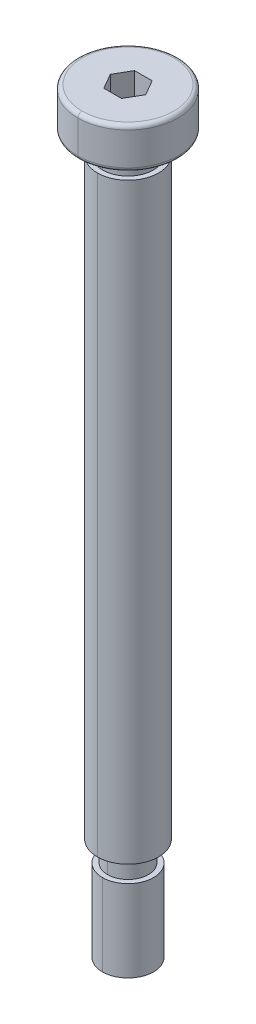
ISO-10303-21;
HEADER;
FILE_DESCRIPTION(('STEP AP214'),'2;1');
FILE_NAME('part.step','',(''),(''),'','','');
FILE_SCHEMA(('AUTOMOTIVE_DESIGN { 1 0 10303 214 1 1 1 1 }'));
ENDSEC;
DATA;
#1=APPLICATION_CONTEXT('core data for automotive mechanical design processes');
#2=APPLICATION_PROTOCOL_DEFINITION('international standard','automotive_design',2000,#1);
#3=PRODUCT_CONTEXT('',#1,'mechanical');
#4=PRODUCT('Part','Part','',(#3));
#5=PRODUCT_RELATED_PRODUCT_CATEGORY('part','',(#4));
#6=PRODUCT_DEFINITION_FORMATION('','',#4);
#7=PRODUCT_DEFINITION_CONTEXT('part definition',#1,'design');
#8=PRODUCT_DEFINITION('design','',#6,#7);
#9=PRODUCT_DEFINITION_SHAPE('','',#8);
#10=(LENGTH_UNIT() NAMED_UNIT(*) SI_UNIT(.MILLI.,.METRE.));
#11=(NAMED_UNIT(*) PLANE_ANGLE_UNIT() SI_UNIT($,.RADIAN.));
#12=(NAMED_UNIT(*) SI_UNIT($,.STERADIAN.) SOLID_ANGLE_UNIT());
#13=UNCERTAINTY_MEASURE_WITH_UNIT(LENGTH_MEASURE(1.E-05),#10,'distance_accuracy_value','');
#14=(GEOMETRIC_REPRESENTATION_CONTEXT(3) GLOBAL_UNCERTAINTY_ASSIGNED_CONTEXT((#13)) GLOBAL_UNIT_ASSIGNED_CONTEXT((#10,
#11,#12)) REPRESENTATION_CONTEXT('',''));
#15=CARTESIAN_POINT('',(0.,0.,0.));
#16=DIRECTION('',(0.,0.,1.));
#17=DIRECTION('',(1.,0.,0.));
#18=AXIS2_PLACEMENT_3D('',#15,#16,#17);
#19=CARTESIAN_POINT('',(0.,70.5,0.));
#20=DIRECTION('',(0.,1.,0.));
#21=DIRECTION('',(1.,0.,0.));
#22=AXIS2_PLACEMENT_3D('',#19,#20,#21);
#23=PLANE('',#22);
#24=DIRECTION('',(-0.5,0.,-0.866025403784439));
#25=VECTOR('',#24,1.);
#26=CARTESIAN_POINT('',(1.73205080756888,70.5,0.));
#27=LINE('',#26,#25);
#28=CARTESIAN_POINT('',(1.73205080756888,70.5,0.));
#29=VERTEX_POINT('',#28);
#30=CARTESIAN_POINT('',(0.866025403784438,70.5,-1.5));
#31=VERTEX_POINT('',#30);
#32=EDGE_CURVE('E305',#29,#31,#27,.T.);
#33=ORIENTED_EDGE('',*,*,#32,.T.);
#34=DIRECTION('',(-1.,0.,0.));
#35=VECTOR('',#34,1.);
#36=CARTESIAN_POINT('',(0.866025403784438,70.5,-1.5));
#37=LINE('',#36,#35);
#38=CARTESIAN_POINT('',(-0.866025403784439,70.5,-1.5));
#39=VERTEX_POINT('',#38);
#40=EDGE_CURVE('E10',#31,#39,#37,.T.);
#41=ORIENTED_EDGE('',*,*,#40,.T.);
#42=DIRECTION('',(-0.5,0.,0.866025403784439));
#43=VECTOR('',#42,1.);
#44=CARTESIAN_POINT('',(-0.866025403784439,70.5,-1.5));
#45=LINE('',#44,#43);
#46=CARTESIAN_POINT('',(-1.73205080756888,70.5,0.));
#47=VERTEX_POINT('',#46);
#48=EDGE_CURVE('E44',#39,#47,#45,.T.);
#49=ORIENTED_EDGE('',*,*,#48,.T.);
#50=DIRECTION('',(0.5,0.,0.866025403784439));
#51=VECTOR('',#50,1.);
#52=CARTESIAN_POINT('',(-1.73205080756888,70.5,0.));
#53=LINE('',#52,#51);
#54=CARTESIAN_POINT('',(-0.866025403784439,70.5,1.5));
#55=VERTEX_POINT('',#54);
#56=EDGE_CURVE('E284',#47,#55,#53,.T.);
#57=ORIENTED_EDGE('',*,*,#56,.T.);
#58=DIRECTION('',(1.,0.,0.));
#59=VECTOR('',#58,1.);
#60=CARTESIAN_POINT('',(-0.866025403784439,70.5,1.5));
#61=LINE('',#60,#59);
#62=CARTESIAN_POINT('',(0.866025403784438,70.5,1.5));
#63=VERTEX_POINT('',#62);
#64=EDGE_CURVE('E325',#55,#63,#61,.T.);
#65=ORIENTED_EDGE('',*,*,#64,.T.);
#66=DIRECTION('',(0.5,0.,-0.866025403784439));
#67=VECTOR('',#66,1.);
#68=CARTESIAN_POINT('',(0.866025403784438,70.5,1.5));
#69=LINE('',#68,#67);
#70=EDGE_CURVE('E310',#63,#29,#69,.T.);
#71=ORIENTED_EDGE('',*,*,#70,.T.);
#72=EDGE_LOOP('',(#33,#41,#49,#57,#65,#71));
#73=FACE_BOUND('',#72,.T.);
#74=ADVANCED_FACE('F16',(#73),#23,.T.);
#75=CARTESIAN_POINT('',(0.866025403784438,70.5,-1.5));
#76=DIRECTION('',(0.,0.,-1.));
#77=DIRECTION('',(-1.,0.,0.));
#78=AXIS2_PLACEMENT_3D('',#75,#76,#77);
#79=PLANE('',#78);
#80=DIRECTION('',(-1.,0.,0.));
#81=VECTOR('',#80,1.);
#82=CARTESIAN_POINT('',(0.866025403784438,74.,-1.5));
#83=LINE('',#82,#81);
#84=CARTESIAN_POINT('',(0.866025403784438,74.,-1.5));
#85=VERTEX_POINT('',#84);
#86=CARTESIAN_POINT('',(-0.866025403784439,74.,-1.5));
#87=VERTEX_POINT('',#86);
#88=EDGE_CURVE('E259',#85,#87,#83,.T.);
#89=ORIENTED_EDGE('',*,*,#88,.T.);
#90=DIRECTION('',(0.,1.,0.));
#91=VECTOR('',#90,1.);
#92=CARTESIAN_POINT('',(-0.866025403784439,70.5,-1.5));
#93=LINE('',#92,#91);
#94=EDGE_CURVE('E19',#39,#87,#93,.T.);
#95=ORIENTED_EDGE('',*,*,#94,.F.);
#96=ORIENTED_EDGE('',*,*,#40,.F.);
#97=DIRECTION('',(0.,1.,0.));
#98=VECTOR('',#97,1.);
#99=CARTESIAN_POINT('',(0.866025403784438,70.5,-1.5));
#100=LINE('',#99,#98);
#101=EDGE_CURVE('E302',#31,#85,#100,.T.);
#102=ORIENTED_EDGE('',*,*,#101,.T.);
#103=EDGE_LOOP('',(#89,#95,#96,#102));
#104=FACE_BOUND('',#103,.T.);
#105=ADVANCED_FACE('F401',(#104),#79,.F.);
#106=CARTESIAN_POINT('',(-0.866025403784439,70.5,-1.5));
#107=DIRECTION('',(-0.866025403784439,0.,-0.5));
#108=DIRECTION('',(-0.5,0.,0.866025403784439));
#109=AXIS2_PLACEMENT_3D('',#106,#107,#108);
#110=PLANE('',#109);
#111=DIRECTION('',(-0.5,0.,0.866025403784439));
#112=VECTOR('',#111,1.);
#113=CARTESIAN_POINT('',(-0.866025403784439,74.,-1.5));
#114=LINE('',#113,#112);
#115=CARTESIAN_POINT('',(-1.73205080756888,74.,0.));
#116=VERTEX_POINT('',#115);
#117=EDGE_CURVE('E350',#87,#116,#114,.T.);
#118=ORIENTED_EDGE('',*,*,#117,.T.);
#119=DIRECTION('',(0.,1.,0.));
#120=VECTOR('',#119,1.);
#121=CARTESIAN_POINT('',(-1.73205080756888,70.5,0.));
#122=LINE('',#121,#120);
#123=EDGE_CURVE('E287',#47,#116,#122,.T.);
#124=ORIENTED_EDGE('',*,*,#123,.F.);
#125=ORIENTED_EDGE('',*,*,#48,.F.);
#126=ORIENTED_EDGE('',*,*,#94,.T.);
#127=EDGE_LOOP('',(#118,#124,#125,#126));
#128=FACE_BOUND('',#127,.T.);
#129=ADVANCED_FACE('F392',(#128),#110,.F.);
#130=CARTESIAN_POINT('',(-1.73205080756888,70.5,0.));
#131=DIRECTION('',(-0.866025403784439,0.,0.5));
#132=DIRECTION('',(0.,1.,0.));
#133=AXIS2_PLACEMENT_3D('',#130,#131,#132);
#134=PLANE('',#133);
#135=DIRECTION('',(0.5,0.,0.866025403784439));
#136=VECTOR('',#135,1.);
#137=CARTESIAN_POINT('',(-1.73205080756888,74.,0.));
#138=LINE('',#137,#136);
#139=CARTESIAN_POINT('',(-0.866025403784439,74.,1.5));
#140=VERTEX_POINT('',#139);
#141=EDGE_CURVE('E346',#116,#140,#138,.T.);
#142=ORIENTED_EDGE('',*,*,#141,.T.);
#143=DIRECTION('',(0.,1.,0.));
#144=VECTOR('',#143,1.);
#145=CARTESIAN_POINT('',(-0.866025403784439,70.5,1.5));
#146=LINE('',#145,#144);
#147=EDGE_CURVE('E288',#55,#140,#146,.T.);
#148=ORIENTED_EDGE('',*,*,#147,.F.);
#149=ORIENTED_EDGE('',*,*,#56,.F.);
#150=ORIENTED_EDGE('',*,*,#123,.T.);
#151=EDGE_LOOP('',(#142,#148,#149,#150));
#152=FACE_BOUND('',#151,.T.);
#153=ADVANCED_FACE('F418',(#152),#134,.F.);
#154=CARTESIAN_POINT('',(-0.866025403784439,70.5,1.5));
#155=DIRECTION('',(0.,0.,1.));
#156=DIRECTION('',(1.,0.,0.));
#157=AXIS2_PLACEMENT_3D('',#154,#155,#156);
#158=PLANE('',#157);
#159=DIRECTION('',(1.,0.,0.));
#160=VECTOR('',#159,1.);
#161=CARTESIAN_POINT('',(-0.866025403784439,74.,1.5));
#162=LINE('',#161,#160);
#163=CARTESIAN_POINT('',(0.866025403784438,74.,1.5));
#164=VERTEX_POINT('',#163);
#165=EDGE_CURVE('E342',#140,#164,#162,.T.);
#166=ORIENTED_EDGE('',*,*,#165,.T.);
#167=DIRECTION('',(0.,1.,0.));
#168=VECTOR('',#167,1.);
#169=CARTESIAN_POINT('',(0.866025403784438,70.5,1.5));
#170=LINE('',#169,#168);
#171=EDGE_CURVE('E312',#63,#164,#170,.T.);
#172=ORIENTED_EDGE('',*,*,#171,.F.);
#173=ORIENTED_EDGE('',*,*,#64,.F.);
#174=ORIENTED_EDGE('',*,*,#147,.T.);
#175=EDGE_LOOP('',(#166,#172,#173,#174));
#176=FACE_BOUND('',#175,.T.);
#177=ADVANCED_FACE('F414',(#176),#158,.F.);
#178=CARTESIAN_POINT('',(0.866025403784438,70.5,1.5));
#179=DIRECTION('',(0.866025403784439,0.,0.5));
#180=DIRECTION('',(0.,-1.,0.));
#181=AXIS2_PLACEMENT_3D('',#178,#179,#180);
#182=PLANE('',#181);
#183=DIRECTION('',(0.5,0.,-0.866025403784439));
#184=VECTOR('',#183,1.);
#185=CARTESIAN_POINT('',(0.866025403784438,74.,1.5));
#186=LINE('',#185,#184);
#187=CARTESIAN_POINT('',(1.73205080756888,74.,0.));
#188=VERTEX_POINT('',#187);
#189=EDGE_CURVE('E258',#164,#188,#186,.T.);
#190=ORIENTED_EDGE('',*,*,#189,.T.);
#191=DIRECTION('',(0.,1.,0.));
#192=VECTOR('',#191,1.);
#193=CARTESIAN_POINT('',(1.73205080756888,70.5,0.));
#194=LINE('',#193,#192);
#195=EDGE_CURVE('E313',#29,#188,#194,.T.);
#196=ORIENTED_EDGE('',*,*,#195,.F.);
#197=ORIENTED_EDGE('',*,*,#70,.F.);
#198=ORIENTED_EDGE('',*,*,#171,.T.);
#199=EDGE_LOOP('',(#190,#196,#197,#198));
#200=FACE_BOUND('',#199,.T.);
#201=ADVANCED_FACE('F409',(#200),#182,.F.);
#202=CARTESIAN_POINT('',(1.73205080756888,70.5,0.));
#203=DIRECTION('',(0.866025403784439,0.,-0.5));
#204=DIRECTION('',(0.,-1.,0.));
#205=AXIS2_PLACEMENT_3D('',#202,#203,#204);
#206=PLANE('',#205);
#207=DIRECTION('',(-0.5,0.,-0.866025403784439));
#208=VECTOR('',#207,1.);
#209=CARTESIAN_POINT('',(1.73205080756888,74.,0.));
#210=LINE('',#209,#208);
#211=EDGE_CURVE('E254',#188,#85,#210,.T.);
#212=ORIENTED_EDGE('',*,*,#211,.T.);
#213=ORIENTED_EDGE('',*,*,#101,.F.);
#214=ORIENTED_EDGE('',*,*,#32,.F.);
#215=ORIENTED_EDGE('',*,*,#195,.T.);
#216=EDGE_LOOP('',(#212,#213,#214,#215));
#217=FACE_BOUND('',#216,.T.);
#218=ADVANCED_FACE('F405',(#217),#206,.F.);
#219=CARTESIAN_POINT('',(-2.5,0.,0.));
#220=DIRECTION('',(0.,1.,0.));
#221=DIRECTION('',(1.,0.,0.));
#222=AXIS2_PLACEMENT_3D('',#219,#220,#221);
#223=PLANE('',#222);
#224=CARTESIAN_POINT('',(0.,0.,0.));
#225=DIRECTION('',(0.,-1.,0.));
#226=DIRECTION('',(0.,0.,-1.));
#227=AXIS2_PLACEMENT_3D('',#224,#225,#226);
#228=CIRCLE('',#227,2.5);
#229=CARTESIAN_POINT('',(0.,0.,-2.5));
#230=VERTEX_POINT('',#229);
#231=CARTESIAN_POINT('',(0.,0.,2.5));
#232=VERTEX_POINT('',#231);
#233=EDGE_CURVE('E202',#230,#232,#228,.T.);
#234=ORIENTED_EDGE('',*,*,#233,.T.);
#235=CARTESIAN_POINT('',(0.,0.,0.));
#236=DIRECTION('',(0.,-1.,0.));
#237=DIRECTION('',(0.,0.,-1.));
#238=AXIS2_PLACEMENT_3D('',#235,#236,#237);
#239=CIRCLE('',#238,2.5);
#240=EDGE_CURVE('E195',#232,#230,#239,.T.);
#241=ORIENTED_EDGE('',*,*,#240,.T.);
#242=EDGE_LOOP('',(#234,#241));
#243=FACE_BOUND('',#242,.T.);
#244=ADVANCED_FACE('F433',(#243),#223,.F.);
#245=CARTESIAN_POINT('',(0.,0.,0.));
#246=DIRECTION('',(0.,-1.,0.));
#247=DIRECTION('',(0.,0.,-1.));
#248=AXIS2_PLACEMENT_3D('',#245,#246,#247);
#249=CYLINDRICAL_SURFACE('',#248,2.5);
#250=DIRECTION('',(0.,-1.,0.));
#251=VECTOR('',#250,1.);
#252=CARTESIAN_POINT('',(0.,0.,2.5));
#253=LINE('',#252,#251);
#254=CARTESIAN_POINT('',(0.,8.,2.5));
#255=VERTEX_POINT('',#254);
#256=EDGE_CURVE('E190',#255,#232,#253,.T.);
#257=ORIENTED_EDGE('',*,*,#256,.F.);
#258=CARTESIAN_POINT('',(0.,8.,0.));
#259=DIRECTION('',(0.,-1.,0.));
#260=DIRECTION('',(0.,0.,-1.));
#261=AXIS2_PLACEMENT_3D('',#258,#259,#260);
#262=CIRCLE('',#261,2.5);
#263=CARTESIAN_POINT('',(0.,8.,-2.5));
#264=VERTEX_POINT('',#263);
#265=EDGE_CURVE('E184',#255,#264,#262,.T.);
#266=ORIENTED_EDGE('',*,*,#265,.T.);
#267=DIRECTION('',(0.,-1.,0.));
#268=VECTOR('',#267,1.);
#269=CARTESIAN_POINT('',(0.,0.,-2.5));
#270=LINE('',#269,#268);
#271=EDGE_CURVE('E187',#264,#230,#270,.T.);
#272=ORIENTED_EDGE('',*,*,#271,.T.);
#273=ORIENTED_EDGE('',*,*,#240,.F.);
#274=EDGE_LOOP('',(#257,#266,#272,#273));
#275=FACE_BOUND('',#274,.T.);
#276=ADVANCED_FACE('F186',(#275),#249,.T.);
#277=CARTESIAN_POINT('',(-2.,8.,0.));
#278=DIRECTION('',(0.,-1.,0.));
#279=DIRECTION('',(0.,0.,-1.));
#280=AXIS2_PLACEMENT_3D('',#277,#278,#279);
#281=PLANE('',#280);
#282=CARTESIAN_POINT('',(0.,8.,0.));
#283=DIRECTION('',(0.,-1.,0.));
#284=DIRECTION('',(0.,0.,-1.));
#285=AXIS2_PLACEMENT_3D('',#282,#283,#284);
#286=CIRCLE('',#285,2.);
#287=CARTESIAN_POINT('',(0.,8.,-2.));
#288=VERTEX_POINT('',#287);
#289=CARTESIAN_POINT('',(0.,8.,2.));
#290=VERTEX_POINT('',#289);
#291=EDGE_CURVE('E247',#288,#290,#286,.T.);
#292=ORIENTED_EDGE('',*,*,#291,.T.);
#293=CARTESIAN_POINT('',(0.,8.,0.));
#294=DIRECTION('',(0.,-1.,0.));
#295=DIRECTION('',(0.,0.,-1.));
#296=AXIS2_PLACEMENT_3D('',#293,#294,#295);
#297=CIRCLE('',#296,2.);
#298=EDGE_CURVE('E196',#290,#288,#297,.T.);
#299=ORIENTED_EDGE('',*,*,#298,.T.);
#300=EDGE_LOOP('',(#292,#299));
#301=FACE_BOUND('',#300,.T.);
#302=CARTESIAN_POINT('',(0.,8.,0.));
#303=DIRECTION('',(0.,-1.,0.));
#304=DIRECTION('',(0.,0.,-1.));
#305=AXIS2_PLACEMENT_3D('',#302,#303,#304);
#306=CIRCLE('',#305,2.5);
#307=EDGE_CURVE('E200',#264,#255,#306,.T.);
#308=ORIENTED_EDGE('',*,*,#307,.F.);
#309=ORIENTED_EDGE('',*,*,#265,.F.);
#310=EDGE_LOOP('',(#308,#309));
#311=FACE_BOUND('',#310,.T.);
#312=ADVANCED_FACE('F206',(#301,#311),#281,.F.);
#313=CARTESIAN_POINT('',(0.,0.,0.));
#314=DIRECTION('',(0.,-1.,0.));
#315=DIRECTION('',(0.,0.,-1.));
#316=AXIS2_PLACEMENT_3D('',#313,#314,#315);
#317=CYLINDRICAL_SURFACE('',#316,2.);
#318=DIRECTION('',(0.,-1.,0.));
#319=VECTOR('',#318,1.);
#320=CARTESIAN_POINT('',(0.,0.,2.));
#321=LINE('',#320,#319);
#322=CARTESIAN_POINT('',(0.,10.,2.));
#323=VERTEX_POINT('',#322);
#324=EDGE_CURVE('E238',#323,#290,#321,.T.);
#325=ORIENTED_EDGE('',*,*,#324,.F.);
#326=CARTESIAN_POINT('',(0.,10.,0.));
#327=DIRECTION('',(0.,-1.,0.));
#328=DIRECTION('',(0.,0.,-1.));
#329=AXIS2_PLACEMENT_3D('',#326,#327,#328);
#330=CIRCLE('',#329,2.);
#331=CARTESIAN_POINT('',(0.,10.,-2.));
#332=VERTEX_POINT('',#331);
#333=EDGE_CURVE('E265',#323,#332,#330,.T.);
#334=ORIENTED_EDGE('',*,*,#333,.T.);
#335=DIRECTION('',(0.,-1.,0.));
#336=VECTOR('',#335,1.);
#337=CARTESIAN_POINT('',(0.,0.,-2.));
#338=LINE('',#337,#336);
#339=EDGE_CURVE('E243',#332,#288,#338,.T.);
#340=ORIENTED_EDGE('',*,*,#339,.T.);
#341=ORIENTED_EDGE('',*,*,#298,.F.);
#342=EDGE_LOOP('',(#325,#334,#340,#341));
#343=FACE_BOUND('',#342,.T.);
#344=ADVANCED_FACE('F441',(#343),#317,.T.);
#345=CARTESIAN_POINT('',(-3.,10.,0.));
#346=DIRECTION('',(0.,1.,0.));
#347=DIRECTION('',(1.,0.,0.));
#348=AXIS2_PLACEMENT_3D('',#345,#346,#347);
#349=PLANE('',#348);
#350=CARTESIAN_POINT('',(0.,10.,0.));
#351=DIRECTION('',(0.,-1.,0.));
#352=DIRECTION('',(0.,0.,-1.));
#353=AXIS2_PLACEMENT_3D('',#350,#351,#352);
#354=CIRCLE('',#353,2.);
#355=EDGE_CURVE('E204',#332,#323,#354,.T.);
#356=ORIENTED_EDGE('',*,*,#355,.F.);
#357=ORIENTED_EDGE('',*,*,#333,.F.);
#358=EDGE_LOOP('',(#356,#357));
#359=FACE_BOUND('',#358,.T.);
#360=CARTESIAN_POINT('',(0.,10.,0.));
#361=DIRECTION('',(0.,-1.,0.));
#362=DIRECTION('',(0.,0.,-1.));
#363=AXIS2_PLACEMENT_3D('',#360,#361,#362);
#364=CIRCLE('',#363,3.);
#365=CARTESIAN_POINT('',(0.,10.,-3.));
#366=VERTEX_POINT('',#365);
#367=CARTESIAN_POINT('',(0.,10.,3.));
#368=VERTEX_POINT('',#367);
#369=EDGE_CURVE('E229',#366,#368,#364,.T.);
#370=ORIENTED_EDGE('',*,*,#369,.T.);
#371=CARTESIAN_POINT('',(0.,10.,0.));
#372=DIRECTION('',(0.,-1.,0.));
#373=DIRECTION('',(0.,0.,-1.));
#374=AXIS2_PLACEMENT_3D('',#371,#372,#373);
#375=CIRCLE('',#374,3.);
#376=EDGE_CURVE('E367',#368,#366,#375,.T.);
#377=ORIENTED_EDGE('',*,*,#376,.T.);
#378=EDGE_LOOP('',(#370,#377));
#379=FACE_BOUND('',#378,.T.);
#380=ADVANCED_FACE('F445',(#359,#379),#349,.F.);
#381=CARTESIAN_POINT('',(0.,0.,0.));
#382=DIRECTION('',(0.,-1.,0.));
#383=DIRECTION('',(0.,0.,-1.));
#384=AXIS2_PLACEMENT_3D('',#381,#382,#383);
#385=CYLINDRICAL_SURFACE('',#384,3.);
#386=DIRECTION('',(0.,-1.,0.));
#387=VECTOR('',#386,1.);
#388=CARTESIAN_POINT('',(0.,0.,3.));
#389=LINE('',#388,#387);
#390=CARTESIAN_POINT('',(0.,68.,3.));
#391=VERTEX_POINT('',#390);
#392=EDGE_CURVE('E234',#391,#368,#389,.T.);
#393=ORIENTED_EDGE('',*,*,#392,.F.);
#394=CARTESIAN_POINT('',(0.,68.,0.));
#395=DIRECTION('',(0.,-1.,0.));
#396=DIRECTION('',(0.,0.,-1.));
#397=AXIS2_PLACEMENT_3D('',#394,#395,#396);
#398=CIRCLE('',#397,3.);
#399=CARTESIAN_POINT('',(0.,68.,-3.));
#400=VERTEX_POINT('',#399);
#401=EDGE_CURVE('E364',#391,#400,#398,.T.);
#402=ORIENTED_EDGE('',*,*,#401,.T.);
#403=DIRECTION('',(0.,-1.,0.));
#404=VECTOR('',#403,1.);
#405=CARTESIAN_POINT('',(0.,0.,-3.));
#406=LINE('',#405,#404);
#407=EDGE_CURVE('E225',#400,#366,#406,.T.);
#408=ORIENTED_EDGE('',*,*,#407,.T.);
#409=ORIENTED_EDGE('',*,*,#376,.F.);
#410=EDGE_LOOP('',(#393,#402,#408,#409));
#411=FACE_BOUND('',#410,.T.);
#412=ADVANCED_FACE('F449',(#411),#385,.T.);
#413=CARTESIAN_POINT('',(-2.5,68.,0.));
#414=DIRECTION('',(0.,-1.,0.));
#415=DIRECTION('',(0.,0.,-1.));
#416=AXIS2_PLACEMENT_3D('',#413,#414,#415);
#417=PLANE('',#416);
#418=CARTESIAN_POINT('',(0.,68.,0.));
#419=DIRECTION('',(0.,-1.,0.));
#420=DIRECTION('',(0.,0.,-1.));
#421=AXIS2_PLACEMENT_3D('',#418,#419,#420);
#422=CIRCLE('',#421,2.5);
#423=CARTESIAN_POINT('',(0.,68.,-2.5));
#424=VERTEX_POINT('',#423);
#425=CARTESIAN_POINT('',(0.,68.,2.5));
#426=VERTEX_POINT('',#425);
#427=EDGE_CURVE('E223',#424,#426,#422,.T.);
#428=ORIENTED_EDGE('',*,*,#427,.T.);
#429=CARTESIAN_POINT('',(0.,68.,0.));
#430=DIRECTION('',(0.,-1.,0.));
#431=DIRECTION('',(0.,0.,-1.));
#432=AXIS2_PLACEMENT_3D('',#429,#430,#431);
#433=CIRCLE('',#432,2.5);
#434=EDGE_CURVE('E361',#426,#424,#433,.T.);
#435=ORIENTED_EDGE('',*,*,#434,.T.);
#436=EDGE_LOOP('',(#428,#435));
#437=FACE_BOUND('',#436,.T.);
#438=CARTESIAN_POINT('',(0.,68.,0.));
#439=DIRECTION('',(0.,-1.,0.));
#440=DIRECTION('',(0.,0.,-1.));
#441=AXIS2_PLACEMENT_3D('',#438,#439,#440);
#442=CIRCLE('',#441,3.);
#443=EDGE_CURVE('E242',#400,#391,#442,.T.);
#444=ORIENTED_EDGE('',*,*,#443,.F.);
#445=ORIENTED_EDGE('',*,*,#401,.F.);
#446=EDGE_LOOP('',(#444,#445));
#447=FACE_BOUND('',#446,.T.);
#448=ADVANCED_FACE('F451',(#437,#447),#417,.F.);
#449=CARTESIAN_POINT('',(0.,0.,0.));
#450=DIRECTION('',(0.,-1.,0.));
#451=DIRECTION('',(0.,0.,-1.));
#452=AXIS2_PLACEMENT_3D('',#449,#450,#451);
#453=CYLINDRICAL_SURFACE('',#452,2.5);
#454=DIRECTION('',(0.,-1.,0.));
#455=VECTOR('',#454,1.);
#456=CARTESIAN_POINT('',(0.,0.,2.5));
#457=LINE('',#456,#455);
#458=CARTESIAN_POINT('',(0.,70.,2.5));
#459=VERTEX_POINT('',#458);
#460=EDGE_CURVE('E217',#459,#426,#457,.T.);
#461=ORIENTED_EDGE('',*,*,#460,.F.);
#462=CARTESIAN_POINT('',(0.,70.,0.));
#463=DIRECTION('',(0.,-1.,0.));
#464=DIRECTION('',(0.,0.,-1.));
#465=AXIS2_PLACEMENT_3D('',#462,#463,#464);
#466=CIRCLE('',#465,2.5);
#467=CARTESIAN_POINT('',(0.,70.,-2.5));
#468=VERTEX_POINT('',#467);
#469=EDGE_CURVE('E292',#459,#468,#466,.T.);
#470=ORIENTED_EDGE('',*,*,#469,.T.);
#471=DIRECTION('',(0.,-1.,0.));
#472=VECTOR('',#471,1.);
#473=CARTESIAN_POINT('',(0.,0.,-2.5));
#474=LINE('',#473,#472);
#475=EDGE_CURVE('E219',#468,#424,#474,.T.);
#476=ORIENTED_EDGE('',*,*,#475,.T.);
#477=ORIENTED_EDGE('',*,*,#434,.F.);
#478=EDGE_LOOP('',(#461,#470,#476,#477));
#479=FACE_BOUND('',#478,.T.);
#480=ADVANCED_FACE('F454',(#479),#453,.T.);
#481=CARTESIAN_POINT('',(-4.5,70.,0.));
#482=DIRECTION('',(0.,1.,0.));
#483=DIRECTION('',(1.,0.,0.));
#484=AXIS2_PLACEMENT_3D('',#481,#482,#483);
#485=PLANE('',#484);
#486=CARTESIAN_POINT('',(0.,70.,0.));
#487=DIRECTION('',(0.,-1.,0.));
#488=DIRECTION('',(0.,0.,-1.));
#489=AXIS2_PLACEMENT_3D('',#486,#487,#488);
#490=CIRCLE('',#489,2.5);
#491=EDGE_CURVE('E228',#468,#459,#490,.T.);
#492=ORIENTED_EDGE('',*,*,#491,.F.);
#493=ORIENTED_EDGE('',*,*,#469,.F.);
#494=EDGE_LOOP('',(#492,#493));
#495=FACE_BOUND('',#494,.T.);
#496=CARTESIAN_POINT('',(0.,70.,0.));
#497=DIRECTION('',(0.,-1.,0.));
#498=DIRECTION('',(0.,0.,-1.));
#499=AXIS2_PLACEMENT_3D('',#496,#497,#498);
#500=CIRCLE('',#499,4.5);
#501=CARTESIAN_POINT('',(0.,70.,-4.5));
#502=VERTEX_POINT('',#501);
#503=CARTESIAN_POINT('',(0.,70.,4.5));
#504=VERTEX_POINT('',#503);
#505=EDGE_CURVE('E279',#502,#504,#500,.T.);
#506=ORIENTED_EDGE('',*,*,#505,.T.);
#507=CARTESIAN_POINT('',(0.,70.,0.));
#508=DIRECTION('',(0.,-1.,0.));
#509=DIRECTION('',(0.,0.,-1.));
#510=AXIS2_PLACEMENT_3D('',#507,#508,#509);
#511=CIRCLE('',#510,4.5);
#512=EDGE_CURVE('E289',#504,#502,#511,.T.);
#513=ORIENTED_EDGE('',*,*,#512,.T.);
#514=EDGE_LOOP('',(#506,#513));
#515=FACE_BOUND('',#514,.T.);
#516=ADVANCED_FACE('F458',(#495,#515),#485,.F.);
#517=CARTESIAN_POINT('',(0.,70.4,0.));
#518=DIRECTION('',(0.,-1.,0.));
#519=DIRECTION('',(0.,0.,-1.));
#520=AXIS2_PLACEMENT_3D('',#517,#518,#519);
#521=TOROIDAL_SURFACE('',#520,4.5,0.4);
#522=CARTESIAN_POINT('',(0.,70.4,4.5));
#523=DIRECTION('',(1.,0.,0.));
#524=DIRECTION('',(0.,0.,-1.));
#525=AXIS2_PLACEMENT_3D('',#522,#523,#524);
#526=CIRCLE('',#525,0.4);
#527=CARTESIAN_POINT('',(0.,70.4,4.9));
#528=VERTEX_POINT('',#527);
#529=EDGE_CURVE('E275',#528,#504,#526,.T.);
#530=ORIENTED_EDGE('',*,*,#529,.F.);
#531=CARTESIAN_POINT('',(0.,70.4,0.));
#532=DIRECTION('',(0.,-1.,0.));
#533=DIRECTION('',(0.,0.,-1.));
#534=AXIS2_PLACEMENT_3D('',#531,#532,#533);
#535=CIRCLE('',#534,4.9);
#536=CARTESIAN_POINT('',(0.,70.4,-4.9));
#537=VERTEX_POINT('',#536);
#538=EDGE_CURVE('E293',#528,#537,#535,.T.);
#539=ORIENTED_EDGE('',*,*,#538,.T.);
#540=CARTESIAN_POINT('',(0.,70.4,-4.5));
#541=DIRECTION('',(-1.,0.,0.));
#542=DIRECTION('',(0.,0.,1.));
#543=AXIS2_PLACEMENT_3D('',#540,#541,#542);
#544=CIRCLE('',#543,0.4);
#545=EDGE_CURVE('E283',#537,#502,#544,.T.);
#546=ORIENTED_EDGE('',*,*,#545,.T.);
#547=ORIENTED_EDGE('',*,*,#512,.F.);
#548=EDGE_LOOP('',(#530,#539,#546,#547));
#549=FACE_BOUND('',#548,.T.);
#550=ADVANCED_FACE('F465',(#549),#521,.T.);
#551=CARTESIAN_POINT('',(0.,0.,0.));
#552=DIRECTION('',(0.,-1.,0.));
#553=DIRECTION('',(0.,0.,-1.));
#554=AXIS2_PLACEMENT_3D('',#551,#552,#553);
#555=CYLINDRICAL_SURFACE('',#554,4.9);
#556=DIRECTION('',(0.,-1.,0.));
#557=VECTOR('',#556,1.);
#558=CARTESIAN_POINT('',(0.,0.,4.9));
#559=LINE('',#558,#557);
#560=CARTESIAN_POINT('',(0.,73.6,4.9));
#561=VERTEX_POINT('',#560);
#562=EDGE_CURVE('E301',#561,#528,#559,.T.);
#563=ORIENTED_EDGE('',*,*,#562,.F.);
#564=CARTESIAN_POINT('',(0.,73.6,0.));
#565=DIRECTION('',(0.,-1.,0.));
#566=DIRECTION('',(0.,0.,-1.));
#567=AXIS2_PLACEMENT_3D('',#564,#565,#566);
#568=CIRCLE('',#567,4.9);
#569=CARTESIAN_POINT('',(0.,73.6,-4.9));
#570=VERTEX_POINT('',#569);
#571=EDGE_CURVE('E354',#561,#570,#568,.T.);
#572=ORIENTED_EDGE('',*,*,#571,.T.);
#573=DIRECTION('',(0.,-1.,0.));
#574=VECTOR('',#573,1.);
#575=CARTESIAN_POINT('',(0.,0.,-4.9));
#576=LINE('',#575,#574);
#577=EDGE_CURVE('E309',#570,#537,#576,.T.);
#578=ORIENTED_EDGE('',*,*,#577,.T.);
#579=ORIENTED_EDGE('',*,*,#538,.F.);
#580=EDGE_LOOP('',(#563,#572,#578,#579));
#581=FACE_BOUND('',#580,.T.);
#582=ADVANCED_FACE('F473',(#581),#555,.T.);
#583=CARTESIAN_POINT('',(0.,73.6,0.));
#584=DIRECTION('',(0.,-1.,0.));
#585=DIRECTION('',(0.,0.,-1.));
#586=AXIS2_PLACEMENT_3D('',#583,#584,#585);
#587=TOROIDAL_SURFACE('',#586,4.5,0.4);
#588=CARTESIAN_POINT('',(0.,73.6,4.5));
#589=DIRECTION('',(1.,0.,0.));
#590=DIRECTION('',(0.,0.,-1.));
#591=AXIS2_PLACEMENT_3D('',#588,#589,#590);
#592=CIRCLE('',#591,0.4);
#593=CARTESIAN_POINT('',(0.,74.,4.5));
#594=VERTEX_POINT('',#593);
#595=EDGE_CURVE('E322',#594,#561,#592,.T.);
#596=ORIENTED_EDGE('',*,*,#595,.F.);
#597=CARTESIAN_POINT('',(0.,74.,0.));
#598=DIRECTION('',(0.,-1.,0.));
#599=DIRECTION('',(0.,0.,-1.));
#600=AXIS2_PLACEMENT_3D('',#597,#598,#599);
#601=CIRCLE('',#600,4.5);
#602=CARTESIAN_POINT('',(0.,74.,-4.5));
#603=VERTEX_POINT('',#602);
#604=EDGE_CURVE('E333',#594,#603,#601,.T.);
#605=ORIENTED_EDGE('',*,*,#604,.T.);
#606=CARTESIAN_POINT('',(0.,73.6,-4.5));
#607=DIRECTION('',(-1.,0.,0.));
#608=DIRECTION('',(0.,0.,1.));
#609=AXIS2_PLACEMENT_3D('',#606,#607,#608);
#610=CIRCLE('',#609,0.4);
#611=EDGE_CURVE('E329',#603,#570,#610,.T.);
#612=ORIENTED_EDGE('',*,*,#611,.T.);
#613=ORIENTED_EDGE('',*,*,#571,.F.);
#614=EDGE_LOOP('',(#596,#605,#612,#613));
#615=FACE_BOUND('',#614,.T.);
#616=ADVANCED_FACE('F477',(#615),#587,.T.);
#617=CARTESIAN_POINT('',(0.,74.,0.));
#618=DIRECTION('',(0.,-1.,0.));
#619=DIRECTION('',(0.,0.,-1.));
#620=AXIS2_PLACEMENT_3D('',#617,#618,#619);
#621=PLANE('',#620);
#622=ORIENTED_EDGE('',*,*,#88,.F.);
#623=ORIENTED_EDGE('',*,*,#211,.F.);
#624=ORIENTED_EDGE('',*,*,#189,.F.);
#625=ORIENTED_EDGE('',*,*,#165,.F.);
#626=ORIENTED_EDGE('',*,*,#141,.F.);
#627=ORIENTED_EDGE('',*,*,#117,.F.);
#628=EDGE_LOOP('',(#622,#623,#624,#625,#626,#627));
#629=FACE_BOUND('',#628,.T.);
#630=CARTESIAN_POINT('',(0.,74.,0.));
#631=DIRECTION('',(0.,-1.,0.));
#632=DIRECTION('',(0.,0.,-1.));
#633=AXIS2_PLACEMENT_3D('',#630,#631,#632);
#634=CIRCLE('',#633,4.5);
#635=EDGE_CURVE('E318',#603,#594,#634,.T.);
#636=ORIENTED_EDGE('',*,*,#635,.F.);
#637=ORIENTED_EDGE('',*,*,#604,.F.);
#638=EDGE_LOOP('',(#636,#637));
#639=FACE_BOUND('',#638,.T.);
#640=ADVANCED_FACE('F397',(#629,#639),#621,.F.);
#641=CARTESIAN_POINT('',(0.,73.6,0.));
#642=DIRECTION('',(0.,-1.,0.));
#643=DIRECTION('',(0.,0.,-1.));
#644=AXIS2_PLACEMENT_3D('',#641,#642,#643);
#645=TOROIDAL_SURFACE('',#644,4.5,0.4);
#646=ORIENTED_EDGE('',*,*,#635,.T.);
#647=ORIENTED_EDGE('',*,*,#595,.T.);
#648=CARTESIAN_POINT('',(0.,73.6,0.));
#649=DIRECTION('',(0.,-1.,0.));
#650=DIRECTION('',(0.,0.,-1.));
#651=AXIS2_PLACEMENT_3D('',#648,#649,#650);
#652=CIRCLE('',#651,4.9);
#653=EDGE_CURVE('E297',#570,#561,#652,.T.);
#654=ORIENTED_EDGE('',*,*,#653,.F.);
#655=ORIENTED_EDGE('',*,*,#611,.F.);
#656=EDGE_LOOP('',(#646,#647,#654,#655));
#657=FACE_BOUND('',#656,.T.);
#658=ADVANCED_FACE('F481',(#657),#645,.T.);
#659=CARTESIAN_POINT('',(0.,0.,0.));
#660=DIRECTION('',(0.,-1.,0.));
#661=DIRECTION('',(0.,0.,-1.));
#662=AXIS2_PLACEMENT_3D('',#659,#660,#661);
#663=CYLINDRICAL_SURFACE('',#662,4.9);
#664=ORIENTED_EDGE('',*,*,#653,.T.);
#665=ORIENTED_EDGE('',*,*,#562,.T.);
#666=CARTESIAN_POINT('',(0.,70.4,0.));
#667=DIRECTION('',(0.,-1.,0.));
#668=DIRECTION('',(0.,0.,-1.));
#669=AXIS2_PLACEMENT_3D('',#666,#667,#668);
#670=CIRCLE('',#669,4.9);
#671=EDGE_CURVE('E222',#537,#528,#670,.T.);
#672=ORIENTED_EDGE('',*,*,#671,.F.);
#673=ORIENTED_EDGE('',*,*,#577,.F.);
#674=EDGE_LOOP('',(#664,#665,#672,#673));
#675=FACE_BOUND('',#674,.T.);
#676=ADVANCED_FACE('F486',(#675),#663,.T.);
#677=CARTESIAN_POINT('',(0.,70.4,0.));
#678=DIRECTION('',(0.,-1.,0.));
#679=DIRECTION('',(0.,0.,-1.));
#680=AXIS2_PLACEMENT_3D('',#677,#678,#679);
#681=TOROIDAL_SURFACE('',#680,4.5,0.4);
#682=ORIENTED_EDGE('',*,*,#671,.T.);
#683=ORIENTED_EDGE('',*,*,#529,.T.);
#684=ORIENTED_EDGE('',*,*,#505,.F.);
#685=ORIENTED_EDGE('',*,*,#545,.F.);
#686=EDGE_LOOP('',(#682,#683,#684,#685));
#687=FACE_BOUND('',#686,.T.);
#688=ADVANCED_FACE('F482',(#687),#681,.T.);
#689=CARTESIAN_POINT('',(0.,0.,0.));
#690=DIRECTION('',(0.,-1.,0.));
#691=DIRECTION('',(0.,0.,-1.));
#692=AXIS2_PLACEMENT_3D('',#689,#690,#691);
#693=CYLINDRICAL_SURFACE('',#692,2.5);
#694=ORIENTED_EDGE('',*,*,#491,.T.);
#695=ORIENTED_EDGE('',*,*,#460,.T.);
#696=ORIENTED_EDGE('',*,*,#427,.F.);
#697=ORIENTED_EDGE('',*,*,#475,.F.);
#698=EDGE_LOOP('',(#694,#695,#696,#697));
#699=FACE_BOUND('',#698,.T.);
#700=ADVANCED_FACE('F485',(#699),#693,.T.);
#701=CARTESIAN_POINT('',(0.,0.,0.));
#702=DIRECTION('',(0.,-1.,0.));
#703=DIRECTION('',(0.,0.,-1.));
#704=AXIS2_PLACEMENT_3D('',#701,#702,#703);
#705=CYLINDRICAL_SURFACE('',#704,3.);
#706=ORIENTED_EDGE('',*,*,#443,.T.);
#707=ORIENTED_EDGE('',*,*,#392,.T.);
#708=ORIENTED_EDGE('',*,*,#369,.F.);
#709=ORIENTED_EDGE('',*,*,#407,.F.);
#710=EDGE_LOOP('',(#706,#707,#708,#709));
#711=FACE_BOUND('',#710,.T.);
#712=ADVANCED_FACE('F490',(#711),#705,.T.);
#713=CARTESIAN_POINT('',(0.,0.,0.));
#714=DIRECTION('',(0.,-1.,0.));
#715=DIRECTION('',(0.,0.,-1.));
#716=AXIS2_PLACEMENT_3D('',#713,#714,#715);
#717=CYLINDRICAL_SURFACE('',#716,2.);
#718=ORIENTED_EDGE('',*,*,#355,.T.);
#719=ORIENTED_EDGE('',*,*,#324,.T.);
#720=ORIENTED_EDGE('',*,*,#291,.F.);
#721=ORIENTED_EDGE('',*,*,#339,.F.);
#722=EDGE_LOOP('',(#718,#719,#720,#721));
#723=FACE_BOUND('',#722,.T.);
#724=ADVANCED_FACE('F494',(#723),#717,.T.);
#725=CARTESIAN_POINT('',(0.,0.,0.));
#726=DIRECTION('',(0.,-1.,0.));
#727=DIRECTION('',(0.,0.,-1.));
#728=AXIS2_PLACEMENT_3D('',#725,#726,#727);
#729=CYLINDRICAL_SURFACE('',#728,2.5);
#730=ORIENTED_EDGE('',*,*,#307,.T.);
#731=ORIENTED_EDGE('',*,*,#256,.T.);
#732=ORIENTED_EDGE('',*,*,#233,.F.);
#733=ORIENTED_EDGE('',*,*,#271,.F.);
#734=EDGE_LOOP('',(#730,#731,#732,#733));
#735=FACE_BOUND('',#734,.T.);
#736=ADVANCED_FACE('F199',(#735),#729,.T.);
#737=CLOSED_SHELL('',(#74,#105,#129,#153,#177,#201,#218,#244,#276,#312,#344,#380,#412,#448,#480,
#516,#550,#582,#616,#640,#658,#676,#688,#700,#712,#724,#736));
#738=MANIFOLD_SOLID_BREP('B1',#737);
#739=ADVANCED_BREP_SHAPE_REPRESENTATION('',(#18,#738),#14);
#740=SHAPE_DEFINITION_REPRESENTATION(#9,#739);
ENDSEC;
END-ISO-10303-21;
